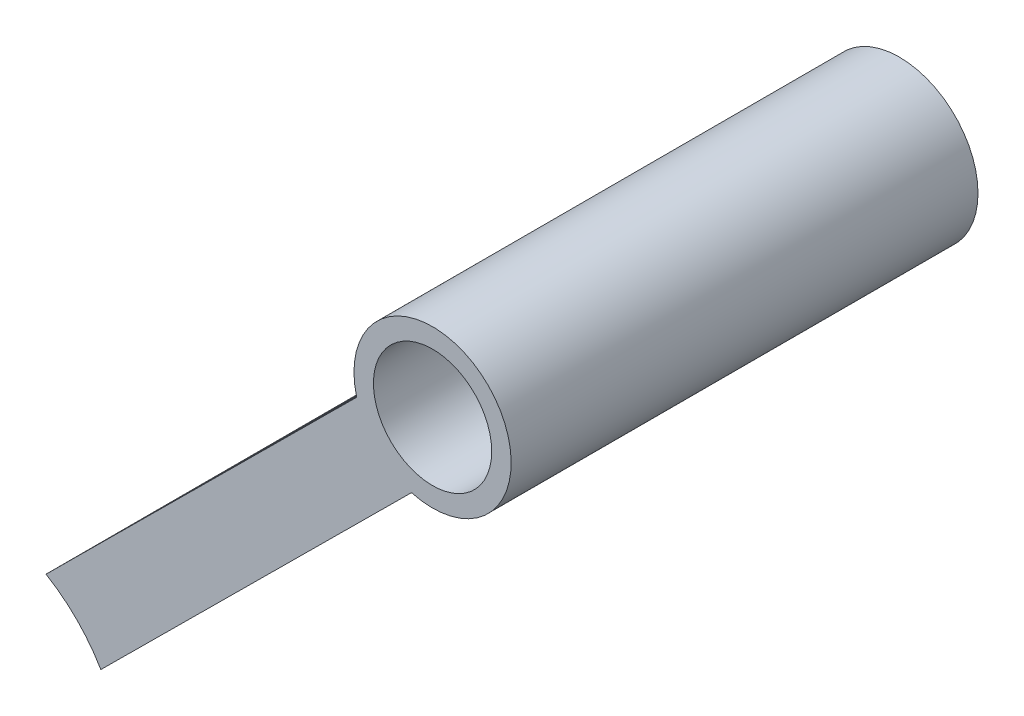
ISO-10303-21;
HEADER;
FILE_DESCRIPTION(('STEP AP214'),'2;1');
FILE_NAME('part.step','',(''),(''),'','','');
FILE_SCHEMA(('AUTOMOTIVE_DESIGN { 1 0 10303 214 1 1 1 1 }'));
ENDSEC;
DATA;
#1=APPLICATION_CONTEXT('core data for automotive mechanical design processes');
#2=APPLICATION_PROTOCOL_DEFINITION('international standard','automotive_design',2000,#1);
#3=PRODUCT_CONTEXT('',#1,'mechanical');
#4=PRODUCT('Part','Part','',(#3));
#5=PRODUCT_RELATED_PRODUCT_CATEGORY('part','',(#4));
#6=PRODUCT_DEFINITION_FORMATION('','',#4);
#7=PRODUCT_DEFINITION_CONTEXT('part definition',#1,'design');
#8=PRODUCT_DEFINITION('design','',#6,#7);
#9=PRODUCT_DEFINITION_SHAPE('','',#8);
#10=(LENGTH_UNIT() NAMED_UNIT(*) SI_UNIT(.MILLI.,.METRE.));
#11=(NAMED_UNIT(*) PLANE_ANGLE_UNIT() SI_UNIT($,.RADIAN.));
#12=(NAMED_UNIT(*) SI_UNIT($,.STERADIAN.) SOLID_ANGLE_UNIT());
#13=UNCERTAINTY_MEASURE_WITH_UNIT(LENGTH_MEASURE(1.E-05),#10,'distance_accuracy_value','');
#14=(GEOMETRIC_REPRESENTATION_CONTEXT(3) GLOBAL_UNCERTAINTY_ASSIGNED_CONTEXT((#13)) GLOBAL_UNIT_ASSIGNED_CONTEXT((#10,
#11,#12)) REPRESENTATION_CONTEXT('',''));
#15=CARTESIAN_POINT('',(0.,0.,0.));
#16=DIRECTION('',(0.,0.,1.));
#17=DIRECTION('',(1.,0.,0.));
#18=AXIS2_PLACEMENT_3D('',#15,#16,#17);
#19=CARTESIAN_POINT('',(38.0355817476515,37.7748290937021,6.34999999999999));
#20=DIRECTION('',(0.,0.,1.));
#21=DIRECTION('',(1.,0.,0.));
#22=AXIS2_PLACEMENT_3D('',#19,#20,#21);
#23=PLANE('',#22);
#24=CARTESIAN_POINT('',(38.0355817476515,37.7748290937021,6.34999999999999));
#25=DIRECTION('',(0.,0.,1.));
#26=DIRECTION('',(1.,0.,0.));
#27=AXIS2_PLACEMENT_3D('',#24,#25,#26);
#28=CIRCLE('',#27,6.4135);
#29=CARTESIAN_POINT('',(36.3190538311644,31.5953053125423,6.34999999999999));
#30=VERTEX_POINT('',#29);
#31=CARTESIAN_POINT('',(31.8443961971646,36.1008506800296,6.34999999999999));
#32=VERTEX_POINT('',#31);
#33=EDGE_CURVE('E11',#30,#32,#28,.T.);
#34=ORIENTED_EDGE('',*,*,#33,.T.);
#35=DIRECTION('',(-0.709534703541313,-0.704670493543288,0.));
#36=VECTOR('',#35,1.);
#37=CARTESIAN_POINT('',(31.8443961971646,36.1008506800296,6.34999999999999));
#38=LINE('',#37,#36);
#39=CARTESIAN_POINT('',(6.48762226993026,10.9179099319744,6.34999999999999));
#40=VERTEX_POINT('',#39);
#41=EDGE_CURVE('E73',#32,#40,#38,.T.);
#42=ORIENTED_EDGE('',*,*,#41,.T.);
#43=CARTESIAN_POINT('',(0.,0.,6.34999999999999));
#44=DIRECTION('',(0.,0.,-1.));
#45=DIRECTION('',(-1.,0.,0.));
#46=AXIS2_PLACEMENT_3D('',#43,#44,#45);
#47=CIRCLE('',#46,12.7);
#48=CARTESIAN_POINT('',(10.9622799039302,6.41236456448705,6.34999999999999));
#49=VERTEX_POINT('',#48);
#50=EDGE_CURVE('E80',#40,#49,#47,.T.);
#51=ORIENTED_EDGE('',*,*,#50,.T.);
#52=DIRECTION('',(0.709534703541312,0.704670493543289,0.));
#53=VECTOR('',#52,1.);
#54=CARTESIAN_POINT('',(36.3190538311644,31.5953053125422,6.34999999999999));
#55=LINE('',#54,#53);
#56=EDGE_CURVE('E44',#49,#30,#55,.T.);
#57=ORIENTED_EDGE('',*,*,#56,.T.);
#58=EDGE_LOOP('',(#34,#42,#51,#57));
#59=FACE_BOUND('',#58,.T.);
#60=CARTESIAN_POINT('',(38.0355817476515,37.7748290937021,6.34999999999999));
#61=DIRECTION('',(0.,0.,1.));
#62=DIRECTION('',(1.,0.,0.));
#63=AXIS2_PLACEMENT_3D('',#60,#61,#62);
#64=CIRCLE('',#63,4.826);
#65=CARTESIAN_POINT('',(42.8615817476515,37.7748290937021,6.34999999999999));
#66=VERTEX_POINT('',#65);
#67=EDGE_CURVE('E93',#66,#66,#64,.T.);
#68=ORIENTED_EDGE('',*,*,#67,.F.);
#69=EDGE_LOOP('',(#68));
#70=FACE_BOUND('',#69,.T.);
#71=ADVANCED_FACE('F30',(#59,#70),#23,.T.);
#72=CARTESIAN_POINT('',(38.0355817476515,37.7748290937021,-31.75));
#73=DIRECTION('',(0.,0.,1.));
#74=DIRECTION('',(1.,0.,0.));
#75=AXIS2_PLACEMENT_3D('',#72,#73,#74);
#76=PLANE('',#75);
#77=CARTESIAN_POINT('',(38.0355817476515,37.7748290937021,-31.75));
#78=DIRECTION('',(0.,0.,1.));
#79=DIRECTION('',(1.,0.,0.));
#80=AXIS2_PLACEMENT_3D('',#77,#78,#79);
#81=CIRCLE('',#80,6.4135);
#82=CARTESIAN_POINT('',(44.4490817476515,37.7748290937021,-31.75));
#83=VERTEX_POINT('',#82);
#84=EDGE_CURVE('E38',#83,#83,#81,.T.);
#85=ORIENTED_EDGE('',*,*,#84,.F.);
#86=EDGE_LOOP('',(#85));
#87=FACE_BOUND('',#86,.T.);
#88=CARTESIAN_POINT('',(38.0355817476515,37.7748290937021,-31.75));
#89=DIRECTION('',(0.,0.,1.));
#90=DIRECTION('',(1.,0.,0.));
#91=AXIS2_PLACEMENT_3D('',#88,#89,#90);
#92=CIRCLE('',#91,4.826);
#93=CARTESIAN_POINT('',(42.8615817476515,37.7748290937021,-31.75));
#94=VERTEX_POINT('',#93);
#95=EDGE_CURVE('E95',#94,#94,#92,.T.);
#96=ORIENTED_EDGE('',*,*,#95,.T.);
#97=EDGE_LOOP('',(#96));
#98=FACE_BOUND('',#97,.T.);
#99=ADVANCED_FACE('F90',(#87,#98),#76,.F.);
#100=CARTESIAN_POINT('',(38.0355817476515,37.7748290937021,6.34999999999999));
#101=DIRECTION('',(0.,0.,-1.));
#102=DIRECTION('',(-1.,0.,0.));
#103=AXIS2_PLACEMENT_3D('',#100,#101,#102);
#104=CYLINDRICAL_SURFACE('',#103,6.4135);
#105=ORIENTED_EDGE('',*,*,#33,.F.);
#106=DIRECTION('',(0.,0.,1.));
#107=VECTOR('',#106,1.);
#108=CARTESIAN_POINT('',(36.3190538311644,31.5953053125422,-19.05));
#109=LINE('',#108,#107);
#110=CARTESIAN_POINT('',(36.3190538311644,31.5953053125422,-19.05));
#111=VERTEX_POINT('',#110);
#112=EDGE_CURVE('E99',#111,#30,#109,.T.);
#113=ORIENTED_EDGE('',*,*,#112,.F.);
#114=CARTESIAN_POINT('',(38.0355817476515,37.7748290937021,-19.05));
#115=DIRECTION('',(0.,0.,-1.));
#116=DIRECTION('',(1.,0.,0.));
#117=AXIS2_PLACEMENT_3D('',#114,#115,#116);
#118=CIRCLE('',#117,6.4135);
#119=CARTESIAN_POINT('',(31.8443961971646,36.1008506800296,-19.05));
#120=VERTEX_POINT('',#119);
#121=EDGE_CURVE('E52',#111,#120,#118,.T.);
#122=ORIENTED_EDGE('',*,*,#121,.T.);
#123=DIRECTION('',(0.,0.,1.));
#124=VECTOR('',#123,1.);
#125=CARTESIAN_POINT('',(31.8443961971646,36.1008506800296,-19.05));
#126=LINE('',#125,#124);
#127=EDGE_CURVE('E77',#120,#32,#126,.T.);
#128=ORIENTED_EDGE('',*,*,#127,.T.);
#129=EDGE_LOOP('',(#105,#113,#122,#128));
#130=FACE_BOUND('',#129,.T.);
#131=ORIENTED_EDGE('',*,*,#84,.T.);
#132=EDGE_LOOP('',(#131));
#133=FACE_BOUND('',#132,.T.);
#134=ADVANCED_FACE('F32',(#130,#133),#104,.T.);
#135=CARTESIAN_POINT('',(38.0355817476515,37.7748290937021,6.34999999999999));
#136=DIRECTION('',(0.,0.,-1.));
#137=DIRECTION('',(-1.,0.,0.));
#138=AXIS2_PLACEMENT_3D('',#135,#136,#137);
#139=CYLINDRICAL_SURFACE('',#138,4.826);
#140=ORIENTED_EDGE('',*,*,#67,.T.);
#141=EDGE_LOOP('',(#140));
#142=FACE_BOUND('',#141,.T.);
#143=ORIENTED_EDGE('',*,*,#95,.F.);
#144=EDGE_LOOP('',(#143));
#145=FACE_BOUND('',#144,.T.);
#146=ADVANCED_FACE('F127',(#142,#145),#139,.F.);
#147=CARTESIAN_POINT('',(36.3190538311644,31.5953053125422,-19.05));
#148=DIRECTION('',(0.704670493543289,-0.709534703541312,0.));
#149=DIRECTION('',(0.709534703541312,0.704670493543289,0.));
#150=AXIS2_PLACEMENT_3D('',#147,#148,#149);
#151=PLANE('',#150);
#152=ORIENTED_EDGE('',*,*,#56,.F.);
#153=DIRECTION('',(0.,0.,1.));
#154=VECTOR('',#153,1.);
#155=CARTESIAN_POINT('',(10.9622799039302,6.41236456448705,-19.05));
#156=LINE('',#155,#154);
#157=CARTESIAN_POINT('',(10.9622799039302,6.41236456448705,-19.05));
#158=VERTEX_POINT('',#157);
#159=EDGE_CURVE('E103',#158,#49,#156,.T.);
#160=ORIENTED_EDGE('',*,*,#159,.F.);
#161=DIRECTION('',(0.709534703541312,0.704670493543289,0.));
#162=VECTOR('',#161,1.);
#163=CARTESIAN_POINT('',(36.3190538311644,31.5953053125422,-19.05));
#164=LINE('',#163,#162);
#165=EDGE_CURVE('E86',#158,#111,#164,.T.);
#166=ORIENTED_EDGE('',*,*,#165,.T.);
#167=ORIENTED_EDGE('',*,*,#112,.T.);
#168=EDGE_LOOP('',(#152,#160,#166,#167));
#169=FACE_BOUND('',#168,.T.);
#170=ADVANCED_FACE('F116',(#169),#151,.T.);
#171=CARTESIAN_POINT('',(0.,0.,-19.05));
#172=DIRECTION('',(0.,0.,1.));
#173=DIRECTION('',(1.,0.,0.));
#174=AXIS2_PLACEMENT_3D('',#171,#172,#173);
#175=CYLINDRICAL_SURFACE('',#174,12.7);
#176=ORIENTED_EDGE('',*,*,#50,.F.);
#177=DIRECTION('',(0.,0.,1.));
#178=VECTOR('',#177,1.);
#179=CARTESIAN_POINT('',(6.48762226993026,10.9179099319744,-19.05));
#180=LINE('',#179,#178);
#181=CARTESIAN_POINT('',(6.48762226993026,10.9179099319744,-19.05));
#182=VERTEX_POINT('',#181);
#183=EDGE_CURVE('E78',#182,#40,#180,.T.);
#184=ORIENTED_EDGE('',*,*,#183,.F.);
#185=CARTESIAN_POINT('',(0.,0.,-19.05));
#186=DIRECTION('',(0.,0.,-1.));
#187=DIRECTION('',(-1.,0.,0.));
#188=AXIS2_PLACEMENT_3D('',#185,#186,#187);
#189=CIRCLE('',#188,12.7);
#190=EDGE_CURVE('E107',#182,#158,#189,.T.);
#191=ORIENTED_EDGE('',*,*,#190,.T.);
#192=ORIENTED_EDGE('',*,*,#159,.T.);
#193=EDGE_LOOP('',(#176,#184,#191,#192));
#194=FACE_BOUND('',#193,.T.);
#195=ADVANCED_FACE('F119',(#194),#175,.F.);
#196=CARTESIAN_POINT('',(31.8443961971646,36.1008506800296,-19.05));
#197=DIRECTION('',(-0.704670493543288,0.709534703541313,0.));
#198=DIRECTION('',(-0.709534703541313,-0.704670493543288,0.));
#199=AXIS2_PLACEMENT_3D('',#196,#197,#198);
#200=PLANE('',#199);
#201=ORIENTED_EDGE('',*,*,#41,.F.);
#202=ORIENTED_EDGE('',*,*,#127,.F.);
#203=DIRECTION('',(-0.709534703541313,-0.704670493543288,0.));
#204=VECTOR('',#203,1.);
#205=CARTESIAN_POINT('',(31.8443961971646,36.1008506800296,-19.05));
#206=LINE('',#205,#204);
#207=EDGE_CURVE('E110',#120,#182,#206,.T.);
#208=ORIENTED_EDGE('',*,*,#207,.T.);
#209=ORIENTED_EDGE('',*,*,#183,.T.);
#210=EDGE_LOOP('',(#201,#202,#208,#209));
#211=FACE_BOUND('',#210,.T.);
#212=ADVANCED_FACE('F75',(#211),#200,.T.);
#213=CARTESIAN_POINT('',(38.0355817476515,37.7748290937021,-19.05));
#214=DIRECTION('',(0.,0.,1.));
#215=DIRECTION('',(1.,0.,0.));
#216=AXIS2_PLACEMENT_3D('',#213,#214,#215);
#217=PLANE('',#216);
#218=ORIENTED_EDGE('',*,*,#121,.F.);
#219=ORIENTED_EDGE('',*,*,#165,.F.);
#220=ORIENTED_EDGE('',*,*,#190,.F.);
#221=ORIENTED_EDGE('',*,*,#207,.F.);
#222=EDGE_LOOP('',(#218,#219,#220,#221));
#223=FACE_BOUND('',#222,.T.);
#224=ADVANCED_FACE('F118',(#223),#217,.F.);
#225=CLOSED_SHELL('',(#71,#99,#134,#146,#170,#195,#212,#224));
#226=MANIFOLD_SOLID_BREP('B2',#225);
#227=ADVANCED_BREP_SHAPE_REPRESENTATION('',(#18,#226),#14);
#228=SHAPE_DEFINITION_REPRESENTATION(#9,#227);
ENDSEC;
END-ISO-10303-21;
